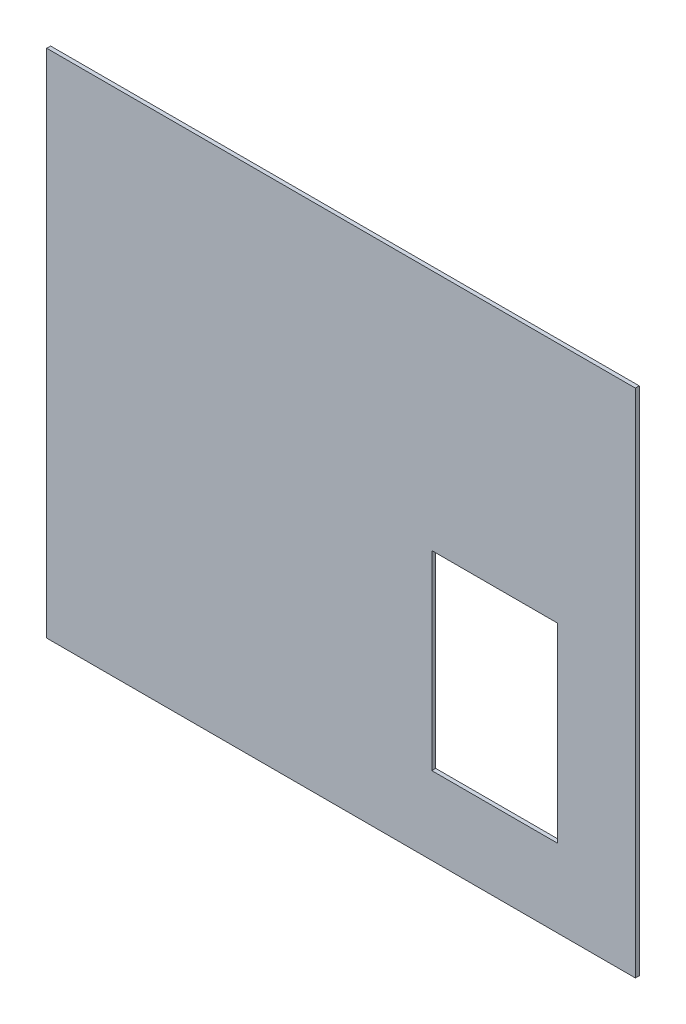
ISO-10303-21;
HEADER;
FILE_DESCRIPTION(('STEP AP214'),'2;1');
FILE_NAME('part.step','',(''),(''),'','','');
FILE_SCHEMA(('AUTOMOTIVE_DESIGN { 1 0 10303 214 1 1 1 1 }'));
ENDSEC;
DATA;
#1=APPLICATION_CONTEXT('core data for automotive mechanical design processes');
#2=APPLICATION_PROTOCOL_DEFINITION('international standard','automotive_design',2000,#1);
#3=PRODUCT_CONTEXT('',#1,'mechanical');
#4=PRODUCT('Part','Part','',(#3));
#5=PRODUCT_RELATED_PRODUCT_CATEGORY('part','',(#4));
#6=PRODUCT_DEFINITION_FORMATION('','',#4);
#7=PRODUCT_DEFINITION_CONTEXT('part definition',#1,'design');
#8=PRODUCT_DEFINITION('design','',#6,#7);
#9=PRODUCT_DEFINITION_SHAPE('','',#8);
#10=(LENGTH_UNIT() NAMED_UNIT(*) SI_UNIT(.MILLI.,.METRE.));
#11=(NAMED_UNIT(*) PLANE_ANGLE_UNIT() SI_UNIT($,.RADIAN.));
#12=(NAMED_UNIT(*) SI_UNIT($,.STERADIAN.) SOLID_ANGLE_UNIT());
#13=UNCERTAINTY_MEASURE_WITH_UNIT(LENGTH_MEASURE(1.E-05),#10,'distance_accuracy_value','');
#14=(GEOMETRIC_REPRESENTATION_CONTEXT(3) GLOBAL_UNCERTAINTY_ASSIGNED_CONTEXT((#13)) GLOBAL_UNIT_ASSIGNED_CONTEXT((#10,
#11,#12)) REPRESENTATION_CONTEXT('',''));
#15=CARTESIAN_POINT('',(0.,0.,0.));
#16=DIRECTION('',(0.,0.,1.));
#17=DIRECTION('',(1.,0.,0.));
#18=AXIS2_PLACEMENT_3D('',#15,#16,#17);
#19=CARTESIAN_POINT('',(227.,197.,0.));
#20=DIRECTION('',(0.,0.,1.));
#21=DIRECTION('',(1.,0.,0.));
#22=AXIS2_PLACEMENT_3D('',#19,#20,#21);
#23=PLANE('',#22);
#24=DIRECTION('',(1.,0.,0.));
#25=VECTOR('',#24,1.);
#26=CARTESIAN_POINT('',(297.,60.,0.));
#27=LINE('',#26,#25);
#28=CARTESIAN_POINT('',(297.,60.,0.));
#29=VERTEX_POINT('',#28);
#30=CARTESIAN_POINT('',(394.,60.,0.));
#31=VERTEX_POINT('',#30);
#32=EDGE_CURVE('E140',#29,#31,#27,.T.);
#33=ORIENTED_EDGE('',*,*,#32,.T.);
#34=DIRECTION('',(0.,1.,0.));
#35=VECTOR('',#34,1.);
#36=CARTESIAN_POINT('',(394.,60.,0.));
#37=LINE('',#36,#35);
#38=CARTESIAN_POINT('',(394.,207.,0.));
#39=VERTEX_POINT('',#38);
#40=EDGE_CURVE('E130',#31,#39,#37,.T.);
#41=ORIENTED_EDGE('',*,*,#40,.T.);
#42=DIRECTION('',(1.,0.,0.));
#43=VECTOR('',#42,1.);
#44=CARTESIAN_POINT('',(394.,207.,0.));
#45=LINE('',#44,#43);
#46=CARTESIAN_POINT('',(297.,207.,0.));
#47=VERTEX_POINT('',#46);
#48=EDGE_CURVE('E124',#39,#47,#45,.F.);
#49=ORIENTED_EDGE('',*,*,#48,.T.);
#50=DIRECTION('',(0.,-1.,0.));
#51=VECTOR('',#50,1.);
#52=CARTESIAN_POINT('',(297.,207.,0.));
#53=LINE('',#52,#51);
#54=EDGE_CURVE('E121',#47,#29,#53,.T.);
#55=ORIENTED_EDGE('',*,*,#54,.T.);
#56=EDGE_LOOP('',(#33,#41,#49,#55));
#57=FACE_BOUND('',#56,.T.);
#58=DIRECTION('',(0.,1.,0.));
#59=VECTOR('',#58,1.);
#60=CARTESIAN_POINT('',(0.,394.,0.));
#61=LINE('',#60,#59);
#62=CARTESIAN_POINT('',(0.,394.,0.));
#63=VERTEX_POINT('',#62);
#64=CARTESIAN_POINT('',(0.,0.,0.));
#65=VERTEX_POINT('',#64);
#66=EDGE_CURVE('E112',#63,#65,#61,.F.);
#67=ORIENTED_EDGE('',*,*,#66,.F.);
#68=DIRECTION('',(1.,0.,0.));
#69=VECTOR('',#68,1.);
#70=CARTESIAN_POINT('',(454.,394.,0.));
#71=LINE('',#70,#69);
#72=CARTESIAN_POINT('',(454.,394.,0.));
#73=VERTEX_POINT('',#72);
#74=EDGE_CURVE('E81',#73,#63,#71,.F.);
#75=ORIENTED_EDGE('',*,*,#74,.F.);
#76=DIRECTION('',(0.,1.,0.));
#77=VECTOR('',#76,1.);
#78=CARTESIAN_POINT('',(454.,0.,0.));
#79=LINE('',#78,#77);
#80=CARTESIAN_POINT('',(454.,0.,0.));
#81=VERTEX_POINT('',#80);
#82=EDGE_CURVE('E83',#81,#73,#79,.T.);
#83=ORIENTED_EDGE('',*,*,#82,.F.);
#84=DIRECTION('',(1.,0.,0.));
#85=VECTOR('',#84,1.);
#86=CARTESIAN_POINT('',(0.,0.,0.));
#87=LINE('',#86,#85);
#88=EDGE_CURVE('E20',#65,#81,#87,.T.);
#89=ORIENTED_EDGE('',*,*,#88,.F.);
#90=EDGE_LOOP('',(#67,#75,#83,#89));
#91=FACE_BOUND('',#90,.T.);
#92=ADVANCED_FACE('F17',(#57,#91),#23,.F.);
#93=CARTESIAN_POINT('',(0.,0.,0.));
#94=DIRECTION('',(0.,-1.,0.));
#95=DIRECTION('',(0.,0.,-1.));
#96=AXIS2_PLACEMENT_3D('',#93,#94,#95);
#97=PLANE('',#96);
#98=DIRECTION('',(1.,0.,0.));
#99=VECTOR('',#98,1.);
#100=CARTESIAN_POINT('',(227.,0.,3.));
#101=LINE('',#100,#99);
#102=CARTESIAN_POINT('',(0.,0.,3.));
#103=VERTEX_POINT('',#102);
#104=CARTESIAN_POINT('',(454.,0.,3.));
#105=VERTEX_POINT('',#104);
#106=EDGE_CURVE('E145',#103,#105,#101,.T.);
#107=ORIENTED_EDGE('',*,*,#106,.F.);
#108=DIRECTION('',(0.,0.,1.));
#109=VECTOR('',#108,1.);
#110=CARTESIAN_POINT('',(0.,0.,0.));
#111=LINE('',#110,#109);
#112=EDGE_CURVE('E95',#65,#103,#111,.T.);
#113=ORIENTED_EDGE('',*,*,#112,.F.);
#114=ORIENTED_EDGE('',*,*,#88,.T.);
#115=DIRECTION('',(0.,0.,-1.));
#116=VECTOR('',#115,1.);
#117=CARTESIAN_POINT('',(454.,0.,0.));
#118=LINE('',#117,#116);
#119=EDGE_CURVE('E90',#105,#81,#118,.T.);
#120=ORIENTED_EDGE('',*,*,#119,.F.);
#121=EDGE_LOOP('',(#107,#113,#114,#120));
#122=FACE_BOUND('',#121,.T.);
#123=ADVANCED_FACE('F92',(#122),#97,.T.);
#124=CARTESIAN_POINT('',(454.,0.,0.));
#125=DIRECTION('',(1.,0.,0.));
#126=DIRECTION('',(0.,0.,-1.));
#127=AXIS2_PLACEMENT_3D('',#124,#125,#126);
#128=PLANE('',#127);
#129=DIRECTION('',(0.,1.,0.));
#130=VECTOR('',#129,1.);
#131=CARTESIAN_POINT('',(454.,197.,3.));
#132=LINE('',#131,#130);
#133=CARTESIAN_POINT('',(454.,394.,3.));
#134=VERTEX_POINT('',#133);
#135=EDGE_CURVE('E100',#105,#134,#132,.T.);
#136=ORIENTED_EDGE('',*,*,#135,.F.);
#137=ORIENTED_EDGE('',*,*,#119,.T.);
#138=ORIENTED_EDGE('',*,*,#82,.T.);
#139=DIRECTION('',(0.,0.,1.));
#140=VECTOR('',#139,1.);
#141=CARTESIAN_POINT('',(454.,394.,0.));
#142=LINE('',#141,#140);
#143=EDGE_CURVE('E107',#134,#73,#142,.F.);
#144=ORIENTED_EDGE('',*,*,#143,.F.);
#145=EDGE_LOOP('',(#136,#137,#138,#144));
#146=FACE_BOUND('',#145,.T.);
#147=ADVANCED_FACE('F98',(#146),#128,.T.);
#148=CARTESIAN_POINT('',(454.,394.,0.));
#149=DIRECTION('',(0.,1.,0.));
#150=DIRECTION('',(0.,0.,1.));
#151=AXIS2_PLACEMENT_3D('',#148,#149,#150);
#152=PLANE('',#151);
#153=DIRECTION('',(1.,0.,0.));
#154=VECTOR('',#153,1.);
#155=CARTESIAN_POINT('',(227.,394.,3.));
#156=LINE('',#155,#154);
#157=CARTESIAN_POINT('',(0.,394.,3.));
#158=VERTEX_POINT('',#157);
#159=EDGE_CURVE('E149',#134,#158,#156,.F.);
#160=ORIENTED_EDGE('',*,*,#159,.F.);
#161=ORIENTED_EDGE('',*,*,#143,.T.);
#162=ORIENTED_EDGE('',*,*,#74,.T.);
#163=DIRECTION('',(0.,0.,1.));
#164=VECTOR('',#163,1.);
#165=CARTESIAN_POINT('',(0.,394.,0.));
#166=LINE('',#165,#164);
#167=EDGE_CURVE('E117',#158,#63,#166,.F.);
#168=ORIENTED_EDGE('',*,*,#167,.F.);
#169=EDGE_LOOP('',(#160,#161,#162,#168));
#170=FACE_BOUND('',#169,.T.);
#171=ADVANCED_FACE('F202',(#170),#152,.T.);
#172=CARTESIAN_POINT('',(0.,394.,0.));
#173=DIRECTION('',(-1.,0.,0.));
#174=DIRECTION('',(0.,0.,1.));
#175=AXIS2_PLACEMENT_3D('',#172,#173,#174);
#176=PLANE('',#175);
#177=DIRECTION('',(0.,1.,0.));
#178=VECTOR('',#177,1.);
#179=CARTESIAN_POINT('',(0.,197.,3.));
#180=LINE('',#179,#178);
#181=EDGE_CURVE('E153',#158,#103,#180,.F.);
#182=ORIENTED_EDGE('',*,*,#181,.F.);
#183=ORIENTED_EDGE('',*,*,#167,.T.);
#184=ORIENTED_EDGE('',*,*,#66,.T.);
#185=ORIENTED_EDGE('',*,*,#112,.T.);
#186=EDGE_LOOP('',(#182,#183,#184,#185));
#187=FACE_BOUND('',#186,.T.);
#188=ADVANCED_FACE('F199',(#187),#176,.T.);
#189=CARTESIAN_POINT('',(297.,207.,0.));
#190=DIRECTION('',(-1.,0.,0.));
#191=DIRECTION('',(0.,-1.,0.));
#192=AXIS2_PLACEMENT_3D('',#189,#190,#191);
#193=PLANE('',#192);
#194=DIRECTION('',(0.,0.,-1.));
#195=VECTOR('',#194,1.);
#196=CARTESIAN_POINT('',(297.,60.,0.));
#197=LINE('',#196,#195);
#198=CARTESIAN_POINT('',(297.,60.,3.));
#199=VERTEX_POINT('',#198);
#200=EDGE_CURVE('E136',#199,#29,#197,.T.);
#201=ORIENTED_EDGE('',*,*,#200,.T.);
#202=ORIENTED_EDGE('',*,*,#54,.F.);
#203=DIRECTION('',(0.,0.,1.));
#204=VECTOR('',#203,1.);
#205=CARTESIAN_POINT('',(297.,207.,0.));
#206=LINE('',#205,#204);
#207=CARTESIAN_POINT('',(297.,207.,3.));
#208=VERTEX_POINT('',#207);
#209=EDGE_CURVE('E127',#47,#208,#206,.T.);
#210=ORIENTED_EDGE('',*,*,#209,.T.);
#211=DIRECTION('',(0.,1.,0.));
#212=VECTOR('',#211,1.);
#213=CARTESIAN_POINT('',(297.,197.,3.));
#214=LINE('',#213,#212);
#215=EDGE_CURVE('E157',#199,#208,#214,.T.);
#216=ORIENTED_EDGE('',*,*,#215,.F.);
#217=EDGE_LOOP('',(#201,#202,#210,#216));
#218=FACE_BOUND('',#217,.T.);
#219=ADVANCED_FACE('F180',(#218),#193,.F.);
#220=CARTESIAN_POINT('',(394.,207.,0.));
#221=DIRECTION('',(0.,1.,0.));
#222=DIRECTION('',(0.,0.,1.));
#223=AXIS2_PLACEMENT_3D('',#220,#221,#222);
#224=PLANE('',#223);
#225=ORIENTED_EDGE('',*,*,#209,.F.);
#226=ORIENTED_EDGE('',*,*,#48,.F.);
#227=DIRECTION('',(0.,0.,1.));
#228=VECTOR('',#227,1.);
#229=CARTESIAN_POINT('',(394.,207.,0.));
#230=LINE('',#229,#228);
#231=CARTESIAN_POINT('',(394.,207.,3.));
#232=VERTEX_POINT('',#231);
#233=EDGE_CURVE('E133',#39,#232,#230,.T.);
#234=ORIENTED_EDGE('',*,*,#233,.T.);
#235=DIRECTION('',(1.,0.,0.));
#236=VECTOR('',#235,1.);
#237=CARTESIAN_POINT('',(227.,207.,3.));
#238=LINE('',#237,#236);
#239=EDGE_CURVE('E161',#208,#232,#238,.T.);
#240=ORIENTED_EDGE('',*,*,#239,.F.);
#241=EDGE_LOOP('',(#225,#226,#234,#240));
#242=FACE_BOUND('',#241,.T.);
#243=ADVANCED_FACE('F176',(#242),#224,.F.);
#244=CARTESIAN_POINT('',(394.,60.,0.));
#245=DIRECTION('',(1.,0.,0.));
#246=DIRECTION('',(0.,1.,0.));
#247=AXIS2_PLACEMENT_3D('',#244,#245,#246);
#248=PLANE('',#247);
#249=ORIENTED_EDGE('',*,*,#233,.F.);
#250=ORIENTED_EDGE('',*,*,#40,.F.);
#251=DIRECTION('',(0.,0.,-1.));
#252=VECTOR('',#251,1.);
#253=CARTESIAN_POINT('',(394.,60.,0.));
#254=LINE('',#253,#252);
#255=CARTESIAN_POINT('',(394.,60.,3.));
#256=VERTEX_POINT('',#255);
#257=EDGE_CURVE('E36',#31,#256,#254,.F.);
#258=ORIENTED_EDGE('',*,*,#257,.T.);
#259=DIRECTION('',(0.,1.,0.));
#260=VECTOR('',#259,1.);
#261=CARTESIAN_POINT('',(394.,197.,3.));
#262=LINE('',#261,#260);
#263=EDGE_CURVE('E27',#232,#256,#262,.F.);
#264=ORIENTED_EDGE('',*,*,#263,.F.);
#265=EDGE_LOOP('',(#249,#250,#258,#264));
#266=FACE_BOUND('',#265,.T.);
#267=ADVANCED_FACE('F172',(#266),#248,.F.);
#268=CARTESIAN_POINT('',(297.,60.,0.));
#269=DIRECTION('',(0.,-1.,0.));
#270=DIRECTION('',(0.,0.,-1.));
#271=AXIS2_PLACEMENT_3D('',#268,#269,#270);
#272=PLANE('',#271);
#273=ORIENTED_EDGE('',*,*,#257,.F.);
#274=ORIENTED_EDGE('',*,*,#32,.F.);
#275=ORIENTED_EDGE('',*,*,#200,.F.);
#276=DIRECTION('',(1.,0.,0.));
#277=VECTOR('',#276,1.);
#278=CARTESIAN_POINT('',(227.,60.,3.));
#279=LINE('',#278,#277);
#280=EDGE_CURVE('E11',#256,#199,#279,.F.);
#281=ORIENTED_EDGE('',*,*,#280,.F.);
#282=EDGE_LOOP('',(#273,#274,#275,#281));
#283=FACE_BOUND('',#282,.T.);
#284=ADVANCED_FACE('F184',(#283),#272,.F.);
#285=CARTESIAN_POINT('',(227.,197.,3.));
#286=DIRECTION('',(0.,0.,1.));
#287=DIRECTION('',(1.,0.,0.));
#288=AXIS2_PLACEMENT_3D('',#285,#286,#287);
#289=PLANE('',#288);
#290=ORIENTED_EDGE('',*,*,#263,.T.);
#291=ORIENTED_EDGE('',*,*,#280,.T.);
#292=ORIENTED_EDGE('',*,*,#215,.T.);
#293=ORIENTED_EDGE('',*,*,#239,.T.);
#294=EDGE_LOOP('',(#290,#291,#292,#293));
#295=FACE_BOUND('',#294,.T.);
#296=ORIENTED_EDGE('',*,*,#159,.T.);
#297=ORIENTED_EDGE('',*,*,#181,.T.);
#298=ORIENTED_EDGE('',*,*,#106,.T.);
#299=ORIENTED_EDGE('',*,*,#135,.T.);
#300=EDGE_LOOP('',(#296,#297,#298,#299));
#301=FACE_BOUND('',#300,.T.);
#302=ADVANCED_FACE('F168',(#295,#301),#289,.T.);
#303=CLOSED_SHELL('',(#92,#123,#147,#171,#188,#219,#243,#267,#284,#302));
#304=MANIFOLD_SOLID_BREP('B1',#303);
#305=ADVANCED_BREP_SHAPE_REPRESENTATION('',(#18,#304),#14);
#306=SHAPE_DEFINITION_REPRESENTATION(#9,#305);
ENDSEC;
END-ISO-10303-21;
